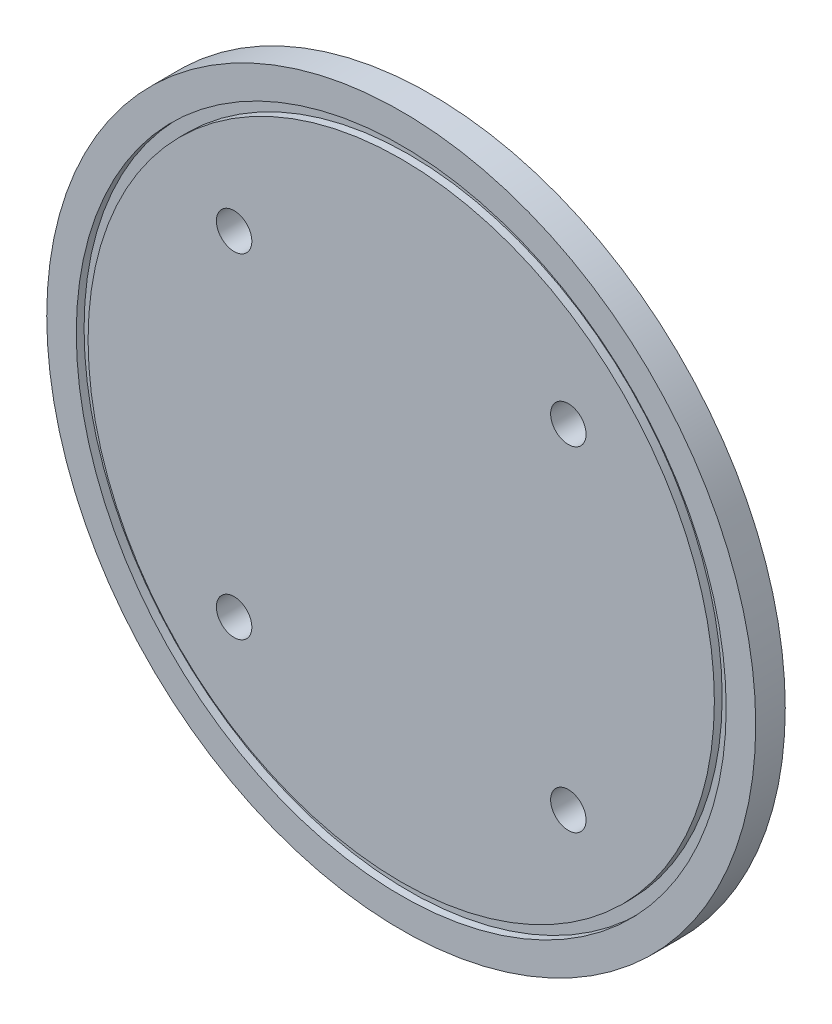
ISO-10303-21;
HEADER;
FILE_DESCRIPTION(('STEP AP214'),'2;1');
FILE_NAME('part.step','',(''),(''),'','','');
FILE_SCHEMA(('AUTOMOTIVE_DESIGN { 1 0 10303 214 1 1 1 1 }'));
ENDSEC;
DATA;
#1=APPLICATION_CONTEXT('core data for automotive mechanical design processes');
#2=APPLICATION_PROTOCOL_DEFINITION('international standard','automotive_design',2000,#1);
#3=PRODUCT_CONTEXT('',#1,'mechanical');
#4=PRODUCT('Part','Part','',(#3));
#5=PRODUCT_RELATED_PRODUCT_CATEGORY('part','',(#4));
#6=PRODUCT_DEFINITION_FORMATION('','',#4);
#7=PRODUCT_DEFINITION_CONTEXT('part definition',#1,'design');
#8=PRODUCT_DEFINITION('design','',#6,#7);
#9=PRODUCT_DEFINITION_SHAPE('','',#8);
#10=(LENGTH_UNIT() NAMED_UNIT(*) SI_UNIT(.MILLI.,.METRE.));
#11=(NAMED_UNIT(*) PLANE_ANGLE_UNIT() SI_UNIT($,.RADIAN.));
#12=(NAMED_UNIT(*) SI_UNIT($,.STERADIAN.) SOLID_ANGLE_UNIT());
#13=UNCERTAINTY_MEASURE_WITH_UNIT(LENGTH_MEASURE(1.E-05),#10,'distance_accuracy_value','');
#14=(GEOMETRIC_REPRESENTATION_CONTEXT(3) GLOBAL_UNCERTAINTY_ASSIGNED_CONTEXT((#13)) GLOBAL_UNIT_ASSIGNED_CONTEXT((#10,
#11,#12)) REPRESENTATION_CONTEXT('',''));
#15=CARTESIAN_POINT('',(0.,0.,0.));
#16=DIRECTION('',(0.,0.,1.));
#17=DIRECTION('',(1.,0.,0.));
#18=AXIS2_PLACEMENT_3D('',#15,#16,#17);
#19=CARTESIAN_POINT('',(0.,0.,5.));
#20=DIRECTION('',(0.,0.,1.));
#21=DIRECTION('',(1.,0.,0.));
#22=AXIS2_PLACEMENT_3D('',#19,#20,#21);
#23=PLANE('',#22);
#24=CARTESIAN_POINT('',(0.,0.,5.));
#25=DIRECTION('',(0.,0.,1.));
#26=DIRECTION('',(1.,0.,0.));
#27=AXIS2_PLACEMENT_3D('',#24,#25,#26);
#28=CIRCLE('',#27,55.);
#29=CARTESIAN_POINT('',(55.,0.,5.));
#30=VERTEX_POINT('',#29);
#31=EDGE_CURVE('E64',#30,#30,#28,.T.);
#32=ORIENTED_EDGE('',*,*,#31,.F.);
#33=EDGE_LOOP('',(#32));
#34=FACE_BOUND('',#33,.T.);
#35=CARTESIAN_POINT('',(0.,0.,5.));
#36=DIRECTION('',(0.,0.,1.));
#37=DIRECTION('',(1.,0.,0.));
#38=AXIS2_PLACEMENT_3D('',#35,#36,#37);
#39=CIRCLE('',#38,60.);
#40=CARTESIAN_POINT('',(60.,0.,5.));
#41=VERTEX_POINT('',#40);
#42=EDGE_CURVE('E76',#41,#41,#39,.T.);
#43=ORIENTED_EDGE('',*,*,#42,.T.);
#44=EDGE_LOOP('',(#43));
#45=FACE_BOUND('',#44,.T.);
#46=ADVANCED_FACE('F33',(#34,#45),#23,.T.);
#47=CARTESIAN_POINT('',(0.,0.,0.));
#48=DIRECTION('',(0.,0.,1.));
#49=DIRECTION('',(1.,0.,0.));
#50=AXIS2_PLACEMENT_3D('',#47,#48,#49);
#51=PLANE('',#50);
#52=CARTESIAN_POINT('',(28.2842712474618,28.284271247462,0.));
#53=DIRECTION('',(0.,0.,1.));
#54=DIRECTION('',(1.,0.,0.));
#55=AXIS2_PLACEMENT_3D('',#52,#53,#54);
#56=CIRCLE('',#55,3.);
#57=CARTESIAN_POINT('',(31.2842712474618,28.284271247462,0.));
#58=VERTEX_POINT('',#57);
#59=EDGE_CURVE('E10',#58,#58,#56,.T.);
#60=ORIENTED_EDGE('',*,*,#59,.T.);
#61=EDGE_LOOP('',(#60));
#62=FACE_BOUND('',#61,.T.);
#63=CARTESIAN_POINT('',(28.2842712474622,-28.2842712474616,0.));
#64=DIRECTION('',(0.,0.,1.));
#65=DIRECTION('',(0.,-1.,0.));
#66=AXIS2_PLACEMENT_3D('',#63,#64,#65);
#67=CIRCLE('',#66,3.);
#68=CARTESIAN_POINT('',(28.2842712474623,-31.2842712474615,0.));
#69=VERTEX_POINT('',#68);
#70=EDGE_CURVE('E49',#69,#69,#67,.T.);
#71=ORIENTED_EDGE('',*,*,#70,.T.);
#72=EDGE_LOOP('',(#71));
#73=FACE_BOUND('',#72,.T.);
#74=CARTESIAN_POINT('',(-28.2842712474618,-28.284271247462,0.));
#75=DIRECTION('',(0.,0.,1.));
#76=DIRECTION('',(-1.,0.,0.));
#77=AXIS2_PLACEMENT_3D('',#74,#75,#76);
#78=CIRCLE('',#77,3.);
#79=CARTESIAN_POINT('',(-31.2842712474618,-28.284271247462,0.));
#80=VERTEX_POINT('',#79);
#81=EDGE_CURVE('E56',#80,#80,#78,.T.);
#82=ORIENTED_EDGE('',*,*,#81,.T.);
#83=EDGE_LOOP('',(#82));
#84=FACE_BOUND('',#83,.T.);
#85=CARTESIAN_POINT('',(-28.2842712474621,28.2842712474617,0.));
#86=DIRECTION('',(0.,0.,1.));
#87=DIRECTION('',(0.,1.,0.));
#88=AXIS2_PLACEMENT_3D('',#85,#86,#87);
#89=CIRCLE('',#88,3.);
#90=CARTESIAN_POINT('',(-28.2842712474621,31.2842712474617,0.));
#91=VERTEX_POINT('',#90);
#92=EDGE_CURVE('E44',#91,#91,#89,.T.);
#93=ORIENTED_EDGE('',*,*,#92,.T.);
#94=EDGE_LOOP('',(#93));
#95=FACE_BOUND('',#94,.T.);
#96=CARTESIAN_POINT('',(0.,0.,0.));
#97=DIRECTION('',(0.,0.,1.));
#98=DIRECTION('',(1.,0.,0.));
#99=AXIS2_PLACEMENT_3D('',#96,#97,#98);
#100=CIRCLE('',#99,60.);
#101=CARTESIAN_POINT('',(60.,0.,0.));
#102=VERTEX_POINT('',#101);
#103=EDGE_CURVE('E73',#102,#102,#100,.T.);
#104=ORIENTED_EDGE('',*,*,#103,.F.);
#105=EDGE_LOOP('',(#104));
#106=FACE_BOUND('',#105,.T.);
#107=ADVANCED_FACE('F35',(#62,#73,#84,#95,#106),#51,.F.);
#108=CARTESIAN_POINT('',(28.2842712474618,28.284271247462,5.));
#109=DIRECTION('',(0.,0.,1.));
#110=DIRECTION('',(1.,0.,0.));
#111=AXIS2_PLACEMENT_3D('',#108,#109,#110);
#112=CIRCLE('',#111,3.);
#113=CARTESIAN_POINT('',(31.2842712474618,28.284271247462,5.));
#114=VERTEX_POINT('',#113);
#115=EDGE_CURVE('E37',#114,#114,#112,.T.);
#116=ORIENTED_EDGE('',*,*,#115,.F.);
#117=EDGE_LOOP('',(#116));
#118=FACE_BOUND('',#117,.T.);
#119=CARTESIAN_POINT('',(28.2842712474622,-28.2842712474616,5.));
#120=DIRECTION('',(0.,0.,1.));
#121=DIRECTION('',(0.,-1.,0.));
#122=AXIS2_PLACEMENT_3D('',#119,#120,#121);
#123=CIRCLE('',#122,3.);
#124=CARTESIAN_POINT('',(28.2842712474623,-31.2842712474615,5.));
#125=VERTEX_POINT('',#124);
#126=EDGE_CURVE('E46',#125,#125,#123,.T.);
#127=ORIENTED_EDGE('',*,*,#126,.F.);
#128=EDGE_LOOP('',(#127));
#129=FACE_BOUND('',#128,.T.);
#130=CARTESIAN_POINT('',(-28.2842712474618,-28.284271247462,5.));
#131=DIRECTION('',(0.,0.,1.));
#132=DIRECTION('',(-1.,0.,0.));
#133=AXIS2_PLACEMENT_3D('',#130,#131,#132);
#134=CIRCLE('',#133,3.);
#135=CARTESIAN_POINT('',(-31.2842712474618,-28.284271247462,5.));
#136=VERTEX_POINT('',#135);
#137=EDGE_CURVE('E53',#136,#136,#134,.T.);
#138=ORIENTED_EDGE('',*,*,#137,.F.);
#139=EDGE_LOOP('',(#138));
#140=FACE_BOUND('',#139,.T.);
#141=CARTESIAN_POINT('',(-28.2842712474621,28.2842712474617,5.));
#142=DIRECTION('',(0.,0.,1.));
#143=DIRECTION('',(0.,1.,0.));
#144=AXIS2_PLACEMENT_3D('',#141,#142,#143);
#145=CIRCLE('',#144,3.);
#146=CARTESIAN_POINT('',(-28.2842712474621,31.2842712474617,5.));
#147=VERTEX_POINT('',#146);
#148=EDGE_CURVE('E59',#147,#147,#145,.T.);
#149=ORIENTED_EDGE('',*,*,#148,.F.);
#150=EDGE_LOOP('',(#149));
#151=FACE_BOUND('',#150,.T.);
#152=CARTESIAN_POINT('',(0.,0.,5.));
#153=DIRECTION('',(0.,0.,1.));
#154=DIRECTION('',(1.,0.,0.));
#155=AXIS2_PLACEMENT_3D('',#152,#153,#154);
#156=CIRCLE('',#155,53.);
#157=CARTESIAN_POINT('',(53.,0.,5.));
#158=VERTEX_POINT('',#157);
#159=EDGE_CURVE('E70',#158,#158,#156,.T.);
#160=ORIENTED_EDGE('',*,*,#159,.T.);
#161=EDGE_LOOP('',(#160));
#162=FACE_BOUND('',#161,.T.);
#163=ADVANCED_FACE('F86',(#118,#129,#140,#151,#162),#23,.T.);
#164=CARTESIAN_POINT('',(28.2842712474618,28.284271247462,0.));
#165=DIRECTION('',(0.,0.,1.));
#166=DIRECTION('',(1.,0.,0.));
#167=AXIS2_PLACEMENT_3D('',#164,#165,#166);
#168=CYLINDRICAL_SURFACE('',#167,3.);
#169=ORIENTED_EDGE('',*,*,#59,.F.);
#170=EDGE_LOOP('',(#169));
#171=FACE_BOUND('',#170,.T.);
#172=ORIENTED_EDGE('',*,*,#115,.T.);
#173=EDGE_LOOP('',(#172));
#174=FACE_BOUND('',#173,.T.);
#175=ADVANCED_FACE('F91',(#171,#174),#168,.F.);
#176=CARTESIAN_POINT('',(28.2842712474622,-28.2842712474616,0.));
#177=DIRECTION('',(0.,0.,1.));
#178=DIRECTION('',(1.,0.,0.));
#179=AXIS2_PLACEMENT_3D('',#176,#177,#178);
#180=CYLINDRICAL_SURFACE('',#179,3.);
#181=ORIENTED_EDGE('',*,*,#70,.F.);
#182=EDGE_LOOP('',(#181));
#183=FACE_BOUND('',#182,.T.);
#184=ORIENTED_EDGE('',*,*,#126,.T.);
#185=EDGE_LOOP('',(#184));
#186=FACE_BOUND('',#185,.T.);
#187=ADVANCED_FACE('F130',(#183,#186),#180,.F.);
#188=CARTESIAN_POINT('',(-28.2842712474618,-28.284271247462,0.));
#189=DIRECTION('',(0.,0.,1.));
#190=DIRECTION('',(1.,0.,0.));
#191=AXIS2_PLACEMENT_3D('',#188,#189,#190);
#192=CYLINDRICAL_SURFACE('',#191,3.);
#193=ORIENTED_EDGE('',*,*,#81,.F.);
#194=EDGE_LOOP('',(#193));
#195=FACE_BOUND('',#194,.T.);
#196=ORIENTED_EDGE('',*,*,#137,.T.);
#197=EDGE_LOOP('',(#196));
#198=FACE_BOUND('',#197,.T.);
#199=ADVANCED_FACE('F105',(#195,#198),#192,.F.);
#200=CARTESIAN_POINT('',(-28.2842712474621,28.2842712474617,0.));
#201=DIRECTION('',(0.,0.,1.));
#202=DIRECTION('',(1.,0.,0.));
#203=AXIS2_PLACEMENT_3D('',#200,#201,#202);
#204=CYLINDRICAL_SURFACE('',#203,3.);
#205=ORIENTED_EDGE('',*,*,#92,.F.);
#206=EDGE_LOOP('',(#205));
#207=FACE_BOUND('',#206,.T.);
#208=ORIENTED_EDGE('',*,*,#148,.T.);
#209=EDGE_LOOP('',(#208));
#210=FACE_BOUND('',#209,.T.);
#211=ADVANCED_FACE('F101',(#207,#210),#204,.F.);
#212=CARTESIAN_POINT('',(0.,0.,3.6792));
#213=DIRECTION('',(0.,0.,1.));
#214=DIRECTION('',(1.,0.,0.));
#215=AXIS2_PLACEMENT_3D('',#212,#213,#214);
#216=CYLINDRICAL_SURFACE('',#215,55.);
#217=CARTESIAN_POINT('',(0.,0.,3.6792));
#218=DIRECTION('',(0.,0.,1.));
#219=DIRECTION('',(1.,0.,0.));
#220=AXIS2_PLACEMENT_3D('',#217,#218,#219);
#221=CIRCLE('',#220,55.);
#222=CARTESIAN_POINT('',(55.,0.,3.6792));
#223=VERTEX_POINT('',#222);
#224=EDGE_CURVE('E50',#223,#223,#221,.T.);
#225=ORIENTED_EDGE('',*,*,#224,.F.);
#226=EDGE_LOOP('',(#225));
#227=FACE_BOUND('',#226,.T.);
#228=ORIENTED_EDGE('',*,*,#31,.T.);
#229=EDGE_LOOP('',(#228));
#230=FACE_BOUND('',#229,.T.);
#231=ADVANCED_FACE('F104',(#227,#230),#216,.F.);
#232=CARTESIAN_POINT('',(0.,0.,3.6792));
#233=DIRECTION('',(0.,0.,1.));
#234=DIRECTION('',(1.,0.,0.));
#235=AXIS2_PLACEMENT_3D('',#232,#233,#234);
#236=PLANE('',#235);
#237=CARTESIAN_POINT('',(0.,0.,3.6792));
#238=DIRECTION('',(0.,0.,1.));
#239=DIRECTION('',(1.,0.,0.));
#240=AXIS2_PLACEMENT_3D('',#237,#238,#239);
#241=CIRCLE('',#240,53.);
#242=CARTESIAN_POINT('',(53.,0.,3.6792));
#243=VERTEX_POINT('',#242);
#244=EDGE_CURVE('E67',#243,#243,#241,.T.);
#245=ORIENTED_EDGE('',*,*,#244,.F.);
#246=EDGE_LOOP('',(#245));
#247=FACE_BOUND('',#246,.T.);
#248=ORIENTED_EDGE('',*,*,#224,.T.);
#249=EDGE_LOOP('',(#248));
#250=FACE_BOUND('',#249,.T.);
#251=ADVANCED_FACE('F114',(#247,#250),#236,.T.);
#252=CARTESIAN_POINT('',(0.,0.,3.6792));
#253=DIRECTION('',(0.,0.,1.));
#254=DIRECTION('',(1.,0.,0.));
#255=AXIS2_PLACEMENT_3D('',#252,#253,#254);
#256=CYLINDRICAL_SURFACE('',#255,53.);
#257=ORIENTED_EDGE('',*,*,#244,.T.);
#258=EDGE_LOOP('',(#257));
#259=FACE_BOUND('',#258,.T.);
#260=ORIENTED_EDGE('',*,*,#159,.F.);
#261=EDGE_LOOP('',(#260));
#262=FACE_BOUND('',#261,.T.);
#263=ADVANCED_FACE('F112',(#259,#262),#256,.T.);
#264=CARTESIAN_POINT('',(0.,0.,0.));
#265=DIRECTION('',(0.,0.,1.));
#266=DIRECTION('',(1.,0.,0.));
#267=AXIS2_PLACEMENT_3D('',#264,#265,#266);
#268=CYLINDRICAL_SURFACE('',#267,60.);
#269=ORIENTED_EDGE('',*,*,#103,.T.);
#270=EDGE_LOOP('',(#269));
#271=FACE_BOUND('',#270,.T.);
#272=ORIENTED_EDGE('',*,*,#42,.F.);
#273=EDGE_LOOP('',(#272));
#274=FACE_BOUND('',#273,.T.);
#275=ADVANCED_FACE('F82',(#271,#274),#268,.T.);
#276=CLOSED_SHELL('',(#46,#107,#163,#175,#187,#199,#211,#231,#251,#263,#275));
#277=MANIFOLD_SOLID_BREP('B2',#276);
#278=ADVANCED_BREP_SHAPE_REPRESENTATION('',(#18,#277),#14);
#279=SHAPE_DEFINITION_REPRESENTATION(#9,#278);
ENDSEC;
END-ISO-10303-21;
